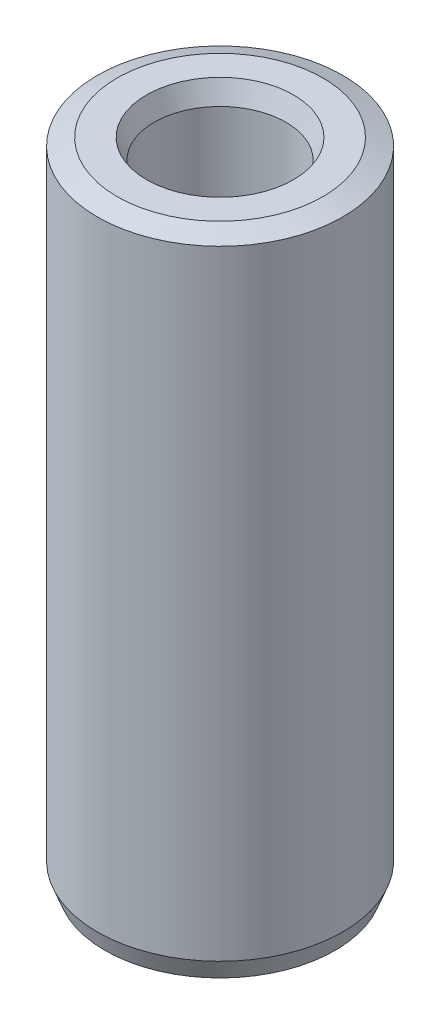
ISO-10303-21;
HEADER;
FILE_DESCRIPTION(('STEP AP214'),'2;1');
FILE_NAME('part.step','',(''),(''),'','','');
FILE_SCHEMA(('AUTOMOTIVE_DESIGN { 1 0 10303 214 1 1 1 1 }'));
ENDSEC;
DATA;
#1=APPLICATION_CONTEXT('core data for automotive mechanical design processes');
#2=APPLICATION_PROTOCOL_DEFINITION('international standard','automotive_design',2000,#1);
#3=PRODUCT_CONTEXT('',#1,'mechanical');
#4=PRODUCT('Part','Part','',(#3));
#5=PRODUCT_RELATED_PRODUCT_CATEGORY('part','',(#4));
#6=PRODUCT_DEFINITION_FORMATION('','',#4);
#7=PRODUCT_DEFINITION_CONTEXT('part definition',#1,'design');
#8=PRODUCT_DEFINITION('design','',#6,#7);
#9=PRODUCT_DEFINITION_SHAPE('','',#8);
#10=(LENGTH_UNIT() NAMED_UNIT(*) SI_UNIT(.MILLI.,.METRE.));
#11=(NAMED_UNIT(*) PLANE_ANGLE_UNIT() SI_UNIT($,.RADIAN.));
#12=(NAMED_UNIT(*) SI_UNIT($,.STERADIAN.) SOLID_ANGLE_UNIT());
#13=UNCERTAINTY_MEASURE_WITH_UNIT(LENGTH_MEASURE(1.E-05),#10,'distance_accuracy_value','');
#14=(GEOMETRIC_REPRESENTATION_CONTEXT(3) GLOBAL_UNCERTAINTY_ASSIGNED_CONTEXT((#13)) GLOBAL_UNIT_ASSIGNED_CONTEXT((#10,
#11,#12)) REPRESENTATION_CONTEXT('',''));
#15=CARTESIAN_POINT('',(0.,0.,0.));
#16=DIRECTION('',(0.,0.,1.));
#17=DIRECTION('',(1.,0.,0.));
#18=AXIS2_PLACEMENT_3D('',#15,#16,#17);
#19=CARTESIAN_POINT('',(0.,263.521187923564,0.));
#20=DIRECTION('',(0.,-1.,0.));
#21=DIRECTION('',(0.,0.,-1.));
#22=AXIS2_PLACEMENT_3D('',#19,#20,#21);
#23=CYLINDRICAL_SURFACE('',#22,50.);
#24=CARTESIAN_POINT('',(0.,8.08927731861231,0.));
#25=DIRECTION('',(0.,1.,0.));
#26=DIRECTION('',(0.,0.,1.));
#27=AXIS2_PLACEMENT_3D('',#24,#25,#26);
#28=CIRCLE('',#27,50.);
#29=CARTESIAN_POINT('',(0.,8.08927731861231,50.));
#30=VERTEX_POINT('',#29);
#31=EDGE_CURVE('E10',#30,#30,#28,.T.);
#32=ORIENTED_EDGE('',*,*,#31,.T.);
#33=EDGE_LOOP('',(#32));
#34=FACE_BOUND('',#33,.T.);
#35=CARTESIAN_POINT('',(0.,260.407064293378,0.));
#36=DIRECTION('',(0.,1.,0.));
#37=DIRECTION('',(0.,0.,1.));
#38=AXIS2_PLACEMENT_3D('',#35,#36,#37);
#39=CIRCLE('',#38,50.);
#40=CARTESIAN_POINT('',(0.,260.407064293378,50.));
#41=VERTEX_POINT('',#40);
#42=EDGE_CURVE('E50',#41,#41,#39,.F.);
#43=ORIENTED_EDGE('',*,*,#42,.T.);
#44=EDGE_LOOP('',(#43));
#45=FACE_BOUND('',#44,.T.);
#46=ADVANCED_FACE('F39',(#34,#45),#23,.T.);
#47=CARTESIAN_POINT('',(0.,263.521187923564,0.));
#48=DIRECTION('',(0.,1.,0.));
#49=DIRECTION('',(0.,0.,1.));
#50=AXIS2_PLACEMENT_3D('',#47,#48,#49);
#51=PLANE('',#50);
#52=CARTESIAN_POINT('',(0.,263.521187923564,0.));
#53=DIRECTION('',(0.,1.,0.));
#54=DIRECTION('',(0.,0.,1.));
#55=AXIS2_PLACEMENT_3D('',#52,#53,#54);
#56=CIRCLE('',#55,29.952936600672);
#57=CARTESIAN_POINT('',(0.,263.521187923564,29.952936600672));
#58=VERTEX_POINT('',#57);
#59=EDGE_CURVE('E58',#58,#58,#56,.F.);
#60=ORIENTED_EDGE('',*,*,#59,.T.);
#61=EDGE_LOOP('',(#60));
#62=FACE_BOUND('',#61,.T.);
#63=CARTESIAN_POINT('',(0.,263.521187923564,0.));
#64=DIRECTION('',(0.,1.,0.));
#65=DIRECTION('',(0.,0.,1.));
#66=AXIS2_PLACEMENT_3D('',#63,#64,#65);
#67=CIRCLE('',#66,41.9107226813877);
#68=CARTESIAN_POINT('',(0.,263.521187923564,41.9107226813877));
#69=VERTEX_POINT('',#68);
#70=EDGE_CURVE('E61',#69,#69,#67,.T.);
#71=ORIENTED_EDGE('',*,*,#70,.T.);
#72=EDGE_LOOP('',(#71));
#73=FACE_BOUND('',#72,.T.);
#74=ADVANCED_FACE('F88',(#62,#73),#51,.T.);
#75=CARTESIAN_POINT('',(0.,0.,0.));
#76=DIRECTION('',(0.,1.,0.));
#77=DIRECTION('',(0.,0.,1.));
#78=AXIS2_PLACEMENT_3D('',#75,#76,#77);
#79=PLANE('',#78);
#80=CARTESIAN_POINT('',(0.,0.,0.));
#81=DIRECTION('',(0.,1.,0.));
#82=DIRECTION('',(0.,0.,1.));
#83=AXIS2_PLACEMENT_3D('',#80,#81,#82);
#84=CIRCLE('',#83,34.9280902890988);
#85=CARTESIAN_POINT('',(0.,0.,34.9280902890988));
#86=VERTEX_POINT('',#85);
#87=EDGE_CURVE('E51',#86,#86,#84,.T.);
#88=ORIENTED_EDGE('',*,*,#87,.T.);
#89=EDGE_LOOP('',(#88));
#90=FACE_BOUND('',#89,.T.);
#91=CARTESIAN_POINT('',(0.,0.,0.));
#92=DIRECTION('',(0.,1.,0.));
#93=DIRECTION('',(0.,0.,1.));
#94=AXIS2_PLACEMENT_3D('',#91,#92,#93);
#95=CIRCLE('',#94,46.8858763698146);
#96=CARTESIAN_POINT('',(0.,0.,46.8858763698146));
#97=VERTEX_POINT('',#96);
#98=EDGE_CURVE('E54',#97,#97,#95,.F.);
#99=ORIENTED_EDGE('',*,*,#98,.T.);
#100=EDGE_LOOP('',(#99));
#101=FACE_BOUND('',#100,.T.);
#102=ADVANCED_FACE('F83',(#90,#101),#79,.F.);
#103=CARTESIAN_POINT('',(0.,263.521187923564,0.));
#104=DIRECTION('',(0.,-1.,0.));
#105=DIRECTION('',(0.,0.,-1.));
#106=AXIS2_PLACEMENT_3D('',#103,#104,#105);
#107=CYLINDRICAL_SURFACE('',#106,26.8388129704865);
#108=CARTESIAN_POINT('',(0.,255.431910604951,0.));
#109=DIRECTION('',(0.,1.,0.));
#110=DIRECTION('',(0.,0.,1.));
#111=AXIS2_PLACEMENT_3D('',#108,#109,#110);
#112=CIRCLE('',#111,26.8388129704865);
#113=CARTESIAN_POINT('',(0.,255.431910604951,26.8388129704865));
#114=VERTEX_POINT('',#113);
#115=EDGE_CURVE('E67',#114,#114,#112,.T.);
#116=ORIENTED_EDGE('',*,*,#115,.T.);
#117=EDGE_LOOP('',(#116));
#118=FACE_BOUND('',#117,.T.);
#119=CARTESIAN_POINT('',(0.,3.11412363018537,0.));
#120=DIRECTION('',(0.,1.,0.));
#121=DIRECTION('',(0.,0.,1.));
#122=AXIS2_PLACEMENT_3D('',#119,#120,#121);
#123=CIRCLE('',#122,26.8388129704865);
#124=CARTESIAN_POINT('',(0.,3.11412363018537,26.8388129704865));
#125=VERTEX_POINT('',#124);
#126=EDGE_CURVE('E69',#125,#125,#123,.F.);
#127=ORIENTED_EDGE('',*,*,#126,.T.);
#128=EDGE_LOOP('',(#127));
#129=FACE_BOUND('',#128,.T.);
#130=ADVANCED_FACE('F71',(#118,#129),#107,.F.);
#131=CARTESIAN_POINT('',(0.,255.431910604951,0.));
#132=DIRECTION('',(0.,1.,0.));
#133=DIRECTION('',(0.,0.,1.));
#134=AXIS2_PLACEMENT_3D('',#131,#132,#133);
#135=CONICAL_SURFACE('',#134,26.8388129704865,0.367482126877411);
#136=ORIENTED_EDGE('',*,*,#59,.F.);
#137=EDGE_LOOP('',(#136));
#138=FACE_BOUND('',#137,.T.);
#139=ORIENTED_EDGE('',*,*,#115,.F.);
#140=EDGE_LOOP('',(#139));
#141=FACE_BOUND('',#140,.T.);
#142=ADVANCED_FACE('F77',(#138,#141),#135,.F.);
#143=CARTESIAN_POINT('',(0.,0.,0.));
#144=DIRECTION('',(0.,-1.,0.));
#145=DIRECTION('',(0.,0.,-1.));
#146=AXIS2_PLACEMENT_3D('',#143,#144,#145);
#147=CONICAL_SURFACE('',#146,34.9280902890988,1.20331419991748);
#148=ORIENTED_EDGE('',*,*,#126,.F.);
#149=EDGE_LOOP('',(#148));
#150=FACE_BOUND('',#149,.T.);
#151=ORIENTED_EDGE('',*,*,#87,.F.);
#152=EDGE_LOOP('',(#151));
#153=FACE_BOUND('',#152,.T.);
#154=ADVANCED_FACE('F73',(#150,#153),#147,.F.);
#155=CARTESIAN_POINT('',(0.,8.08927731861231,0.));
#156=DIRECTION('',(0.,1.,0.));
#157=DIRECTION('',(0.,0.,1.));
#158=AXIS2_PLACEMENT_3D('',#155,#156,#157);
#159=CONICAL_SURFACE('',#158,50.,0.367482126877418);
#160=ORIENTED_EDGE('',*,*,#98,.F.);
#161=EDGE_LOOP('',(#160));
#162=FACE_BOUND('',#161,.T.);
#163=ORIENTED_EDGE('',*,*,#31,.F.);
#164=EDGE_LOOP('',(#163));
#165=FACE_BOUND('',#164,.T.);
#166=ADVANCED_FACE('F76',(#162,#165),#159,.T.);
#167=CARTESIAN_POINT('',(0.,263.521187923564,0.));
#168=DIRECTION('',(0.,-1.,0.));
#169=DIRECTION('',(0.,0.,-1.));
#170=AXIS2_PLACEMENT_3D('',#167,#168,#169);
#171=CONICAL_SURFACE('',#170,41.9107226813877,1.20331419991748);
#172=ORIENTED_EDGE('',*,*,#42,.F.);
#173=EDGE_LOOP('',(#172));
#174=FACE_BOUND('',#173,.T.);
#175=ORIENTED_EDGE('',*,*,#70,.F.);
#176=EDGE_LOOP('',(#175));
#177=FACE_BOUND('',#176,.T.);
#178=ADVANCED_FACE('F45',(#174,#177),#171,.T.);
#179=CLOSED_SHELL('',(#46,#74,#102,#130,#142,#154,#166,#178));
#180=MANIFOLD_SOLID_BREP('B2',#179);
#181=ADVANCED_BREP_SHAPE_REPRESENTATION('',(#18,#180),#14);
#182=SHAPE_DEFINITION_REPRESENTATION(#9,#181);
ENDSEC;
END-ISO-10303-21;
